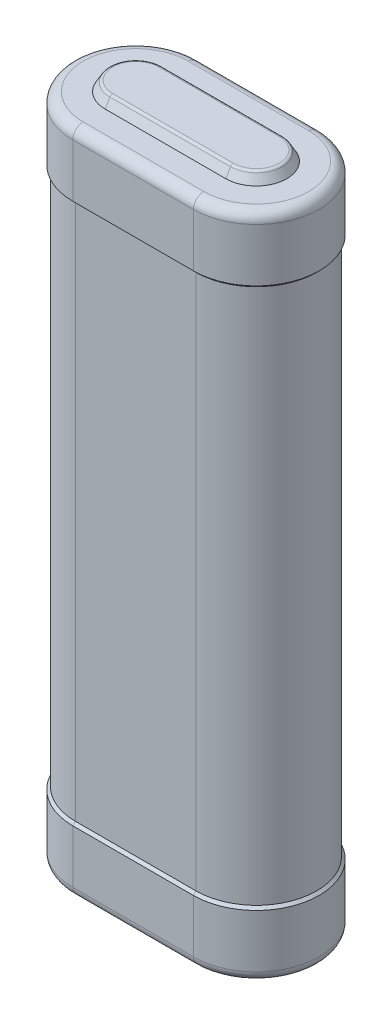
ISO-10303-21;
HEADER;
FILE_DESCRIPTION(('STEP AP214'),'2;1');
FILE_NAME('part.step','',(''),(''),'','','');
FILE_SCHEMA(('AUTOMOTIVE_DESIGN { 1 0 10303 214 1 1 1 1 }'));
ENDSEC;
DATA;
#1=APPLICATION_CONTEXT('core data for automotive mechanical design processes');
#2=APPLICATION_PROTOCOL_DEFINITION('international standard','automotive_design',2000,#1);
#3=PRODUCT_CONTEXT('',#1,'mechanical');
#4=PRODUCT('Part','Part','',(#3));
#5=PRODUCT_RELATED_PRODUCT_CATEGORY('part','',(#4));
#6=PRODUCT_DEFINITION_FORMATION('','',#4);
#7=PRODUCT_DEFINITION_CONTEXT('part definition',#1,'design');
#8=PRODUCT_DEFINITION('design','',#6,#7);
#9=PRODUCT_DEFINITION_SHAPE('','',#8);
#10=(LENGTH_UNIT() NAMED_UNIT(*) SI_UNIT(.MILLI.,.METRE.));
#11=(NAMED_UNIT(*) PLANE_ANGLE_UNIT() SI_UNIT($,.RADIAN.));
#12=(NAMED_UNIT(*) SI_UNIT($,.STERADIAN.) SOLID_ANGLE_UNIT());
#13=UNCERTAINTY_MEASURE_WITH_UNIT(LENGTH_MEASURE(1.E-05),#10,'distance_accuracy_value','');
#14=(GEOMETRIC_REPRESENTATION_CONTEXT(3) GLOBAL_UNCERTAINTY_ASSIGNED_CONTEXT((#13)) GLOBAL_UNIT_ASSIGNED_CONTEXT((#10,
#11,#12)) REPRESENTATION_CONTEXT('',''));
#15=CARTESIAN_POINT('',(0.,0.,0.));
#16=DIRECTION('',(0.,0.,1.));
#17=DIRECTION('',(1.,0.,0.));
#18=AXIS2_PLACEMENT_3D('',#15,#16,#17);
#19=CARTESIAN_POINT('',(-11.811,65.405,-10.287));
#20=DIRECTION('',(0.,1.,0.));
#21=DIRECTION('',(0.,0.,1.));
#22=AXIS2_PLACEMENT_3D('',#19,#20,#21);
#23=PLANE('',#22);
#24=DIRECTION('',(-1.,0.,0.));
#25=VECTOR('',#24,1.);
#26=CARTESIAN_POINT('',(-11.811,65.405,-10.287));
#27=LINE('',#26,#25);
#28=CARTESIAN_POINT('',(-11.811,65.405,-10.287));
#29=VERTEX_POINT('',#28);
#30=CARTESIAN_POINT('',(11.811,65.405,-10.287));
#31=VERTEX_POINT('',#30);
#32=EDGE_CURVE('E176',#29,#31,#27,.F.);
#33=ORIENTED_EDGE('',*,*,#32,.F.);
#34=CARTESIAN_POINT('',(-11.811,65.405,0.));
#35=DIRECTION('',(0.,-1.,0.));
#36=DIRECTION('',(0.,0.,1.));
#37=AXIS2_PLACEMENT_3D('',#34,#35,#36);
#38=CIRCLE('',#37,10.287);
#39=CARTESIAN_POINT('',(-11.811,65.405,10.287));
#40=VERTEX_POINT('',#39);
#41=EDGE_CURVE('E162',#29,#40,#38,.F.);
#42=ORIENTED_EDGE('',*,*,#41,.T.);
#43=DIRECTION('',(1.,0.,0.));
#44=VECTOR('',#43,1.);
#45=CARTESIAN_POINT('',(11.811,65.405,10.287));
#46=LINE('',#45,#44);
#47=CARTESIAN_POINT('',(11.811,65.405,10.287));
#48=VERTEX_POINT('',#47);
#49=EDGE_CURVE('E170',#48,#40,#46,.F.);
#50=ORIENTED_EDGE('',*,*,#49,.F.);
#51=CARTESIAN_POINT('',(11.811,65.405,0.));
#52=DIRECTION('',(0.,-1.,0.));
#53=DIRECTION('',(0.,0.,-1.));
#54=AXIS2_PLACEMENT_3D('',#51,#52,#53);
#55=CIRCLE('',#54,10.287);
#56=EDGE_CURVE('E269',#31,#48,#55,.T.);
#57=ORIENTED_EDGE('',*,*,#56,.F.);
#58=EDGE_LOOP('',(#33,#42,#50,#57));
#59=FACE_BOUND('',#58,.T.);
#60=ADVANCED_FACE('F47',(#59),#23,.T.);
#61=CARTESIAN_POINT('',(-11.811,-65.405,0.));
#62=DIRECTION('',(0.,1.,0.));
#63=DIRECTION('',(0.,0.,1.));
#64=AXIS2_PLACEMENT_3D('',#61,#62,#63);
#65=PLANE('',#64);
#66=DIRECTION('',(1.,0.,0.));
#67=VECTOR('',#66,1.);
#68=CARTESIAN_POINT('',(-11.811,-65.405,10.287));
#69=LINE('',#68,#67);
#70=CARTESIAN_POINT('',(-11.811,-65.405,10.287));
#71=VERTEX_POINT('',#70);
#72=CARTESIAN_POINT('',(11.811,-65.405,10.287));
#73=VERTEX_POINT('',#72);
#74=EDGE_CURVE('E395',#71,#73,#69,.T.);
#75=ORIENTED_EDGE('',*,*,#74,.F.);
#76=CARTESIAN_POINT('',(-11.811,-65.405,0.));
#77=DIRECTION('',(0.,1.,0.));
#78=DIRECTION('',(0.,0.,-1.));
#79=AXIS2_PLACEMENT_3D('',#76,#77,#78);
#80=CIRCLE('',#79,10.287);
#81=CARTESIAN_POINT('',(-11.811,-65.405,-10.287));
#82=VERTEX_POINT('',#81);
#83=EDGE_CURVE('E187',#82,#71,#80,.T.);
#84=ORIENTED_EDGE('',*,*,#83,.F.);
#85=DIRECTION('',(-1.,0.,0.));
#86=VECTOR('',#85,1.);
#87=CARTESIAN_POINT('',(-11.811,-65.405,-10.287));
#88=LINE('',#87,#86);
#89=CARTESIAN_POINT('',(11.811,-65.405,-10.287));
#90=VERTEX_POINT('',#89);
#91=EDGE_CURVE('E260',#90,#82,#88,.T.);
#92=ORIENTED_EDGE('',*,*,#91,.F.);
#93=CARTESIAN_POINT('',(11.811,-65.405,0.));
#94=DIRECTION('',(0.,1.,0.));
#95=DIRECTION('',(0.,0.,1.));
#96=AXIS2_PLACEMENT_3D('',#93,#94,#95);
#97=CIRCLE('',#96,10.287);
#98=EDGE_CURVE('E333',#73,#90,#97,.T.);
#99=ORIENTED_EDGE('',*,*,#98,.F.);
#100=EDGE_LOOP('',(#75,#84,#92,#99));
#101=FACE_BOUND('',#100,.T.);
#102=ADVANCED_FACE('F345',(#101),#65,.F.);
#103=CARTESIAN_POINT('',(11.811,-63.373,0.));
#104=DIRECTION('',(0.,1.,0.));
#105=DIRECTION('',(0.,0.,1.));
#106=AXIS2_PLACEMENT_3D('',#103,#104,#105);
#107=TOROIDAL_SURFACE('',#106,10.287,2.032);
#108=CARTESIAN_POINT('',(11.811,-63.373,10.287));
#109=DIRECTION('',(1.,0.,0.));
#110=DIRECTION('',(0.,0.,1.));
#111=AXIS2_PLACEMENT_3D('',#108,#109,#110);
#112=CIRCLE('',#111,2.032);
#113=CARTESIAN_POINT('',(11.811,-63.373,12.319));
#114=VERTEX_POINT('',#113);
#115=EDGE_CURVE('E358',#114,#73,#112,.T.);
#116=ORIENTED_EDGE('',*,*,#115,.T.);
#117=ORIENTED_EDGE('',*,*,#98,.T.);
#118=CARTESIAN_POINT('',(11.811,-63.373,-10.287));
#119=DIRECTION('',(-1.,0.,0.));
#120=DIRECTION('',(0.,0.,-1.));
#121=AXIS2_PLACEMENT_3D('',#118,#119,#120);
#122=CIRCLE('',#121,2.032);
#123=CARTESIAN_POINT('',(11.811,-63.373,-12.319));
#124=VERTEX_POINT('',#123);
#125=EDGE_CURVE('E366',#90,#124,#122,.F.);
#126=ORIENTED_EDGE('',*,*,#125,.T.);
#127=CARTESIAN_POINT('',(11.811,-63.373,0.));
#128=DIRECTION('',(0.,-1.,0.));
#129=DIRECTION('',(0.,0.,-1.));
#130=AXIS2_PLACEMENT_3D('',#127,#128,#129);
#131=CIRCLE('',#130,12.319);
#132=EDGE_CURVE('E315',#114,#124,#131,.F.);
#133=ORIENTED_EDGE('',*,*,#132,.F.);
#134=EDGE_LOOP('',(#116,#117,#126,#133));
#135=FACE_BOUND('',#134,.T.);
#136=ADVANCED_FACE('F339',(#135),#107,.T.);
#137=CARTESIAN_POINT('',(-11.811,-63.373,10.287));
#138=DIRECTION('',(1.,0.,0.));
#139=DIRECTION('',(0.,0.,-1.));
#140=AXIS2_PLACEMENT_3D('',#137,#138,#139);
#141=CYLINDRICAL_SURFACE('',#140,2.032);
#142=CARTESIAN_POINT('',(-11.811,-63.373,10.287));
#143=DIRECTION('',(1.,0.,0.));
#144=DIRECTION('',(0.,0.,-1.));
#145=AXIS2_PLACEMENT_3D('',#142,#143,#144);
#146=CIRCLE('',#145,2.032);
#147=CARTESIAN_POINT('',(-11.811,-63.373,12.319));
#148=VERTEX_POINT('',#147);
#149=EDGE_CURVE('E184',#148,#71,#146,.T.);
#150=ORIENTED_EDGE('',*,*,#149,.T.);
#151=ORIENTED_EDGE('',*,*,#74,.T.);
#152=ORIENTED_EDGE('',*,*,#115,.F.);
#153=DIRECTION('',(1.,0.,0.));
#154=VECTOR('',#153,1.);
#155=CARTESIAN_POINT('',(11.811,-63.373,12.319));
#156=LINE('',#155,#154);
#157=EDGE_CURVE('E371',#148,#114,#156,.T.);
#158=ORIENTED_EDGE('',*,*,#157,.F.);
#159=EDGE_LOOP('',(#150,#151,#152,#158));
#160=FACE_BOUND('',#159,.T.);
#161=ADVANCED_FACE('F344',(#160),#141,.T.);
#162=CARTESIAN_POINT('',(-11.811,-63.373,0.));
#163=DIRECTION('',(0.,1.,0.));
#164=DIRECTION('',(0.,0.,1.));
#165=AXIS2_PLACEMENT_3D('',#162,#163,#164);
#166=TOROIDAL_SURFACE('',#165,10.287,2.032);
#167=ORIENTED_EDGE('',*,*,#149,.F.);
#168=CARTESIAN_POINT('',(-11.811,-63.373,0.));
#169=DIRECTION('',(0.,-1.,0.));
#170=DIRECTION('',(0.,0.,-1.));
#171=AXIS2_PLACEMENT_3D('',#168,#169,#170);
#172=CIRCLE('',#171,12.319);
#173=CARTESIAN_POINT('',(-11.811,-63.373,-12.319));
#174=VERTEX_POINT('',#173);
#175=EDGE_CURVE('E261',#174,#148,#172,.F.);
#176=ORIENTED_EDGE('',*,*,#175,.F.);
#177=CARTESIAN_POINT('',(-11.811,-63.373,-10.287));
#178=DIRECTION('',(-1.,0.,0.));
#179=DIRECTION('',(0.,0.,1.));
#180=AXIS2_PLACEMENT_3D('',#177,#178,#179);
#181=CIRCLE('',#180,2.032);
#182=EDGE_CURVE('E257',#82,#174,#181,.F.);
#183=ORIENTED_EDGE('',*,*,#182,.F.);
#184=ORIENTED_EDGE('',*,*,#83,.T.);
#185=EDGE_LOOP('',(#167,#176,#183,#184));
#186=FACE_BOUND('',#185,.T.);
#187=ADVANCED_FACE('F221',(#186),#166,.T.);
#188=CARTESIAN_POINT('',(-11.811,-63.373,-10.287));
#189=DIRECTION('',(-1.,0.,0.));
#190=DIRECTION('',(0.,0.,1.));
#191=AXIS2_PLACEMENT_3D('',#188,#189,#190);
#192=CYLINDRICAL_SURFACE('',#191,2.032);
#193=ORIENTED_EDGE('',*,*,#125,.F.);
#194=ORIENTED_EDGE('',*,*,#91,.T.);
#195=ORIENTED_EDGE('',*,*,#182,.T.);
#196=DIRECTION('',(-1.,0.,0.));
#197=VECTOR('',#196,1.);
#198=CARTESIAN_POINT('',(-11.811,-63.373,-12.319));
#199=LINE('',#198,#197);
#200=EDGE_CURVE('E203',#124,#174,#199,.T.);
#201=ORIENTED_EDGE('',*,*,#200,.F.);
#202=EDGE_LOOP('',(#193,#194,#195,#201));
#203=FACE_BOUND('',#202,.T.);
#204=ADVANCED_FACE('F467',(#203),#192,.T.);
#205=CARTESIAN_POINT('',(11.811,-52.451,0.));
#206=DIRECTION('',(0.,-1.,0.));
#207=DIRECTION('',(0.,0.,-1.));
#208=AXIS2_PLACEMENT_3D('',#205,#206,#207);
#209=CYLINDRICAL_SURFACE('',#208,12.319);
#210=DIRECTION('',(0.,-1.,0.));
#211=VECTOR('',#210,1.);
#212=CARTESIAN_POINT('',(11.811,-52.451,12.319));
#213=LINE('',#212,#211);
#214=CARTESIAN_POINT('',(11.811,-52.959,12.319));
#215=VERTEX_POINT('',#214);
#216=EDGE_CURVE('E378',#215,#114,#213,.T.);
#217=ORIENTED_EDGE('',*,*,#216,.T.);
#218=ORIENTED_EDGE('',*,*,#132,.T.);
#219=DIRECTION('',(0.,-1.,0.));
#220=VECTOR('',#219,1.);
#221=CARTESIAN_POINT('',(11.811,-52.451,-12.319));
#222=LINE('',#221,#220);
#223=CARTESIAN_POINT('',(11.811,-52.959,-12.319));
#224=VERTEX_POINT('',#223);
#225=EDGE_CURVE('E318',#124,#224,#222,.F.);
#226=ORIENTED_EDGE('',*,*,#225,.T.);
#227=CARTESIAN_POINT('',(11.811,-52.959,0.));
#228=DIRECTION('',(0.,-1.,0.));
#229=DIRECTION('',(0.,0.,-1.));
#230=AXIS2_PLACEMENT_3D('',#227,#228,#229);
#231=CIRCLE('',#230,12.319);
#232=EDGE_CURVE('E421',#215,#224,#231,.F.);
#233=ORIENTED_EDGE('',*,*,#232,.F.);
#234=EDGE_LOOP('',(#217,#218,#226,#233));
#235=FACE_BOUND('',#234,.T.);
#236=ADVANCED_FACE('F419',(#235),#209,.T.);
#237=CARTESIAN_POINT('',(11.811,-52.451,12.319));
#238=DIRECTION('',(0.,0.,1.));
#239=DIRECTION('',(1.,0.,0.));
#240=AXIS2_PLACEMENT_3D('',#237,#238,#239);
#241=PLANE('',#240);
#242=DIRECTION('',(0.,1.,0.));
#243=VECTOR('',#242,1.);
#244=CARTESIAN_POINT('',(-11.811,-52.451,12.319));
#245=LINE('',#244,#243);
#246=CARTESIAN_POINT('',(-11.811,-52.959,12.319));
#247=VERTEX_POINT('',#246);
#248=EDGE_CURVE('E236',#247,#148,#245,.F.);
#249=ORIENTED_EDGE('',*,*,#248,.T.);
#250=ORIENTED_EDGE('',*,*,#157,.T.);
#251=ORIENTED_EDGE('',*,*,#216,.F.);
#252=DIRECTION('',(1.,0.,0.));
#253=VECTOR('',#252,1.);
#254=CARTESIAN_POINT('',(11.811,-52.959,12.319));
#255=LINE('',#254,#253);
#256=EDGE_CURVE('E324',#247,#215,#255,.T.);
#257=ORIENTED_EDGE('',*,*,#256,.F.);
#258=EDGE_LOOP('',(#249,#250,#251,#257));
#259=FACE_BOUND('',#258,.T.);
#260=ADVANCED_FACE('F349',(#259),#241,.T.);
#261=CARTESIAN_POINT('',(-11.811,-52.451,0.));
#262=DIRECTION('',(0.,-1.,0.));
#263=DIRECTION('',(0.,0.,-1.));
#264=AXIS2_PLACEMENT_3D('',#261,#262,#263);
#265=CYLINDRICAL_SURFACE('',#264,12.319);
#266=DIRECTION('',(0.,1.,0.));
#267=VECTOR('',#266,1.);
#268=CARTESIAN_POINT('',(-11.811,-52.451,-12.319));
#269=LINE('',#268,#267);
#270=CARTESIAN_POINT('',(-11.811,-52.959,-12.319));
#271=VERTEX_POINT('',#270);
#272=EDGE_CURVE('E250',#174,#271,#269,.T.);
#273=ORIENTED_EDGE('',*,*,#272,.F.);
#274=ORIENTED_EDGE('',*,*,#175,.T.);
#275=ORIENTED_EDGE('',*,*,#248,.F.);
#276=CARTESIAN_POINT('',(-11.811,-52.959,0.));
#277=DIRECTION('',(0.,-1.,0.));
#278=DIRECTION('',(0.,0.,-1.));
#279=AXIS2_PLACEMENT_3D('',#276,#277,#278);
#280=CIRCLE('',#279,12.319);
#281=EDGE_CURVE('E252',#271,#247,#280,.F.);
#282=ORIENTED_EDGE('',*,*,#281,.F.);
#283=EDGE_LOOP('',(#273,#274,#275,#282));
#284=FACE_BOUND('',#283,.T.);
#285=ADVANCED_FACE('F464',(#284),#265,.T.);
#286=CARTESIAN_POINT('',(-11.811,-52.451,-12.319));
#287=DIRECTION('',(0.,0.,-1.));
#288=DIRECTION('',(-1.,0.,0.));
#289=AXIS2_PLACEMENT_3D('',#286,#287,#288);
#290=PLANE('',#289);
#291=ORIENTED_EDGE('',*,*,#225,.F.);
#292=ORIENTED_EDGE('',*,*,#200,.T.);
#293=ORIENTED_EDGE('',*,*,#272,.T.);
#294=DIRECTION('',(1.,0.,0.));
#295=VECTOR('',#294,1.);
#296=CARTESIAN_POINT('',(-11.811,-52.959,-12.319));
#297=LINE('',#296,#295);
#298=EDGE_CURVE('E302',#224,#271,#297,.F.);
#299=ORIENTED_EDGE('',*,*,#298,.F.);
#300=EDGE_LOOP('',(#291,#292,#293,#299));
#301=FACE_BOUND('',#300,.T.);
#302=ADVANCED_FACE('F463',(#301),#290,.T.);
#303=CARTESIAN_POINT('',(11.811,-52.959,0.));
#304=DIRECTION('',(0.,-1.,0.));
#305=DIRECTION('',(0.,0.,-1.));
#306=AXIS2_PLACEMENT_3D('',#303,#304,#305);
#307=CONICAL_SURFACE('',#306,12.319,0.785398163397447);
#308=DIRECTION('',(0.,-0.707106781186548,0.707106781186548));
#309=VECTOR('',#308,1.);
#310=CARTESIAN_POINT('',(11.811,-52.959,12.319));
#311=LINE('',#310,#309);
#312=CARTESIAN_POINT('',(11.811,-52.451,11.811));
#313=VERTEX_POINT('',#312);
#314=EDGE_CURVE('E322',#215,#313,#311,.F.);
#315=ORIENTED_EDGE('',*,*,#314,.F.);
#316=ORIENTED_EDGE('',*,*,#232,.T.);
#317=DIRECTION('',(0.,0.707106781186548,0.707106781186547));
#318=VECTOR('',#317,1.);
#319=CARTESIAN_POINT('',(11.811,-52.959,-12.319));
#320=LINE('',#319,#318);
#321=CARTESIAN_POINT('',(11.811,-52.451,-11.811));
#322=VERTEX_POINT('',#321);
#323=EDGE_CURVE('E425',#224,#322,#320,.T.);
#324=ORIENTED_EDGE('',*,*,#323,.T.);
#325=CARTESIAN_POINT('',(11.811,-52.451,0.));
#326=DIRECTION('',(0.,-1.,0.));
#327=DIRECTION('',(0.,0.,-1.));
#328=AXIS2_PLACEMENT_3D('',#325,#326,#327);
#329=CIRCLE('',#328,11.811);
#330=EDGE_CURVE('E58',#313,#322,#329,.F.);
#331=ORIENTED_EDGE('',*,*,#330,.F.);
#332=EDGE_LOOP('',(#315,#316,#324,#331));
#333=FACE_BOUND('',#332,.T.);
#334=ADVANCED_FACE('F460',(#333),#307,.T.);
#335=CARTESIAN_POINT('',(11.811,-52.959,12.319));
#336=DIRECTION('',(0.,0.707106781186548,0.707106781186548));
#337=DIRECTION('',(0.,-0.707106781186548,0.707106781186548));
#338=AXIS2_PLACEMENT_3D('',#335,#336,#337);
#339=PLANE('',#338);
#340=ORIENTED_EDGE('',*,*,#314,.T.);
#341=DIRECTION('',(-1.,0.,0.));
#342=VECTOR('',#341,1.);
#343=CARTESIAN_POINT('',(-11.811,-52.451,11.811));
#344=LINE('',#343,#342);
#345=CARTESIAN_POINT('',(-11.811,-52.451,11.811));
#346=VERTEX_POINT('',#345);
#347=EDGE_CURVE('E406',#313,#346,#344,.T.);
#348=ORIENTED_EDGE('',*,*,#347,.T.);
#349=DIRECTION('',(0.,-0.707106781186548,0.707106781186548));
#350=VECTOR('',#349,1.);
#351=CARTESIAN_POINT('',(-11.811,-52.959,12.319));
#352=LINE('',#351,#350);
#353=EDGE_CURVE('E207',#346,#247,#352,.T.);
#354=ORIENTED_EDGE('',*,*,#353,.T.);
#355=ORIENTED_EDGE('',*,*,#256,.T.);
#356=EDGE_LOOP('',(#340,#348,#354,#355));
#357=FACE_BOUND('',#356,.T.);
#358=ADVANCED_FACE('F403',(#357),#339,.T.);
#359=CARTESIAN_POINT('',(-11.811,-52.959,0.));
#360=DIRECTION('',(0.,-1.,0.));
#361=DIRECTION('',(0.,0.,-1.));
#362=AXIS2_PLACEMENT_3D('',#359,#360,#361);
#363=CONICAL_SURFACE('',#362,12.319,0.785398163397448);
#364=DIRECTION('',(0.,0.707106781186548,0.707106781186547));
#365=VECTOR('',#364,1.);
#366=CARTESIAN_POINT('',(-11.811,-52.959,-12.319));
#367=LINE('',#366,#365);
#368=CARTESIAN_POINT('',(-11.811,-52.451,-11.811));
#369=VERTEX_POINT('',#368);
#370=EDGE_CURVE('E326',#369,#271,#367,.F.);
#371=ORIENTED_EDGE('',*,*,#370,.T.);
#372=ORIENTED_EDGE('',*,*,#281,.T.);
#373=ORIENTED_EDGE('',*,*,#353,.F.);
#374=CARTESIAN_POINT('',(-11.811,-52.451,0.));
#375=DIRECTION('',(0.,-1.,0.));
#376=DIRECTION('',(0.,0.,-1.));
#377=AXIS2_PLACEMENT_3D('',#374,#375,#376);
#378=CIRCLE('',#377,11.811);
#379=EDGE_CURVE('E306',#369,#346,#378,.F.);
#380=ORIENTED_EDGE('',*,*,#379,.F.);
#381=EDGE_LOOP('',(#371,#372,#373,#380));
#382=FACE_BOUND('',#381,.T.);
#383=ADVANCED_FACE('F409',(#382),#363,.T.);
#384=CARTESIAN_POINT('',(-11.811,-52.959,-12.319));
#385=DIRECTION('',(0.,0.707106781186548,-0.707106781186548));
#386=DIRECTION('',(0.,0.707106781186548,0.707106781186548));
#387=AXIS2_PLACEMENT_3D('',#384,#385,#386);
#388=PLANE('',#387);
#389=ORIENTED_EDGE('',*,*,#323,.F.);
#390=ORIENTED_EDGE('',*,*,#298,.T.);
#391=ORIENTED_EDGE('',*,*,#370,.F.);
#392=DIRECTION('',(1.,0.,0.));
#393=VECTOR('',#392,1.);
#394=CARTESIAN_POINT('',(-11.811,-52.451,-11.811));
#395=LINE('',#394,#393);
#396=EDGE_CURVE('E67',#369,#322,#395,.T.);
#397=ORIENTED_EDGE('',*,*,#396,.T.);
#398=EDGE_LOOP('',(#389,#390,#391,#397));
#399=FACE_BOUND('',#398,.T.);
#400=ADVANCED_FACE('F461',(#399),#388,.T.);
#401=CARTESIAN_POINT('',(11.811,65.405,0.));
#402=DIRECTION('',(0.,-1.,0.));
#403=DIRECTION('',(0.,0.,-1.));
#404=AXIS2_PLACEMENT_3D('',#401,#402,#403);
#405=CYLINDRICAL_SURFACE('',#404,11.811);
#406=ORIENTED_EDGE('',*,*,#330,.T.);
#407=DIRECTION('',(0.,-1.,0.));
#408=VECTOR('',#407,1.);
#409=CARTESIAN_POINT('',(11.811,65.405,-11.811));
#410=LINE('',#409,#408);
#411=CARTESIAN_POINT('',(11.811,52.451,-11.811));
#412=VERTEX_POINT('',#411);
#413=EDGE_CURVE('E12',#322,#412,#410,.F.);
#414=ORIENTED_EDGE('',*,*,#413,.T.);
#415=CARTESIAN_POINT('',(11.811,52.451,0.));
#416=DIRECTION('',(0.,-1.,0.));
#417=DIRECTION('',(0.,0.,-1.));
#418=AXIS2_PLACEMENT_3D('',#415,#416,#417);
#419=CIRCLE('',#418,11.811);
#420=CARTESIAN_POINT('',(11.811,52.451,11.811));
#421=VERTEX_POINT('',#420);
#422=EDGE_CURVE('E443',#412,#421,#419,.T.);
#423=ORIENTED_EDGE('',*,*,#422,.T.);
#424=DIRECTION('',(0.,-1.,0.));
#425=VECTOR('',#424,1.);
#426=CARTESIAN_POINT('',(11.811,65.405,11.811));
#427=LINE('',#426,#425);
#428=EDGE_CURVE('E447',#421,#313,#427,.T.);
#429=ORIENTED_EDGE('',*,*,#428,.T.);
#430=EDGE_LOOP('',(#406,#414,#423,#429));
#431=FACE_BOUND('',#430,.T.);
#432=ADVANCED_FACE('F456',(#431),#405,.T.);
#433=CARTESIAN_POINT('',(-11.811,65.405,11.811));
#434=DIRECTION('',(0.,0.,-1.));
#435=DIRECTION('',(-1.,0.,0.));
#436=AXIS2_PLACEMENT_3D('',#433,#434,#435);
#437=PLANE('',#436);
#438=DIRECTION('',(0.,1.,0.));
#439=VECTOR('',#438,1.);
#440=CARTESIAN_POINT('',(-11.811,65.405,11.811));
#441=LINE('',#440,#439);
#442=CARTESIAN_POINT('',(-11.811,52.451,11.811));
#443=VERTEX_POINT('',#442);
#444=EDGE_CURVE('E433',#346,#443,#441,.T.);
#445=ORIENTED_EDGE('',*,*,#444,.F.);
#446=ORIENTED_EDGE('',*,*,#347,.F.);
#447=ORIENTED_EDGE('',*,*,#428,.F.);
#448=DIRECTION('',(-1.,0.,0.));
#449=VECTOR('',#448,1.);
#450=CARTESIAN_POINT('',(-11.811,52.451,11.811));
#451=LINE('',#450,#449);
#452=EDGE_CURVE('E428',#443,#421,#451,.F.);
#453=ORIENTED_EDGE('',*,*,#452,.F.);
#454=EDGE_LOOP('',(#445,#446,#447,#453));
#455=FACE_BOUND('',#454,.T.);
#456=ADVANCED_FACE('F532',(#455),#437,.F.);
#457=CARTESIAN_POINT('',(-11.811,65.405,0.));
#458=DIRECTION('',(0.,-1.,0.));
#459=DIRECTION('',(0.,0.,-1.));
#460=AXIS2_PLACEMENT_3D('',#457,#458,#459);
#461=CYLINDRICAL_SURFACE('',#460,11.811);
#462=ORIENTED_EDGE('',*,*,#379,.T.);
#463=ORIENTED_EDGE('',*,*,#444,.T.);
#464=CARTESIAN_POINT('',(-11.811,52.451,0.));
#465=DIRECTION('',(0.,-1.,0.));
#466=DIRECTION('',(0.,0.,-1.));
#467=AXIS2_PLACEMENT_3D('',#464,#465,#466);
#468=CIRCLE('',#467,11.811);
#469=CARTESIAN_POINT('',(-11.811,52.451,-11.811));
#470=VERTEX_POINT('',#469);
#471=EDGE_CURVE('E312',#443,#470,#468,.T.);
#472=ORIENTED_EDGE('',*,*,#471,.T.);
#473=DIRECTION('',(0.,1.,0.));
#474=VECTOR('',#473,1.);
#475=CARTESIAN_POINT('',(-11.811,65.405,-11.811));
#476=LINE('',#475,#474);
#477=EDGE_CURVE('E424',#470,#369,#476,.F.);
#478=ORIENTED_EDGE('',*,*,#477,.T.);
#479=EDGE_LOOP('',(#462,#463,#472,#478));
#480=FACE_BOUND('',#479,.T.);
#481=ADVANCED_FACE('F534',(#480),#461,.T.);
#482=CARTESIAN_POINT('',(-11.811,65.405,-11.811));
#483=DIRECTION('',(0.,0.,1.));
#484=DIRECTION('',(1.,0.,0.));
#485=AXIS2_PLACEMENT_3D('',#482,#483,#484);
#486=PLANE('',#485);
#487=ORIENTED_EDGE('',*,*,#413,.F.);
#488=ORIENTED_EDGE('',*,*,#396,.F.);
#489=ORIENTED_EDGE('',*,*,#477,.F.);
#490=DIRECTION('',(1.,0.,0.));
#491=VECTOR('',#490,1.);
#492=CARTESIAN_POINT('',(-11.811,52.451,-11.811));
#493=LINE('',#492,#491);
#494=EDGE_CURVE('E448',#412,#470,#493,.F.);
#495=ORIENTED_EDGE('',*,*,#494,.F.);
#496=EDGE_LOOP('',(#487,#488,#489,#495));
#497=FACE_BOUND('',#496,.T.);
#498=ADVANCED_FACE('F453',(#497),#486,.F.);
#499=CARTESIAN_POINT('',(11.811,52.959,0.));
#500=DIRECTION('',(0.,1.,0.));
#501=DIRECTION('',(-1.,0.,0.));
#502=AXIS2_PLACEMENT_3D('',#499,#500,#501);
#503=CONICAL_SURFACE('',#502,12.319,0.785398163397448);
#504=DIRECTION('',(0.,-0.707106781186547,-0.707106781186548));
#505=VECTOR('',#504,1.);
#506=CARTESIAN_POINT('',(11.811,52.451,11.811));
#507=LINE('',#506,#505);
#508=CARTESIAN_POINT('',(11.811,52.959,12.319));
#509=VERTEX_POINT('',#508);
#510=EDGE_CURVE('E437',#509,#421,#507,.T.);
#511=ORIENTED_EDGE('',*,*,#510,.T.);
#512=ORIENTED_EDGE('',*,*,#422,.F.);
#513=DIRECTION('',(0.,-0.707106781186547,0.707106781186548));
#514=VECTOR('',#513,1.);
#515=CARTESIAN_POINT('',(11.811,52.451,-11.811));
#516=LINE('',#515,#514);
#517=CARTESIAN_POINT('',(11.811,52.959,-12.319));
#518=VERTEX_POINT('',#517);
#519=EDGE_CURVE('E299',#412,#518,#516,.F.);
#520=ORIENTED_EDGE('',*,*,#519,.T.);
#521=CARTESIAN_POINT('',(11.811,52.959,0.));
#522=DIRECTION('',(0.,1.,0.));
#523=DIRECTION('',(0.,0.,1.));
#524=AXIS2_PLACEMENT_3D('',#521,#522,#523);
#525=CIRCLE('',#524,12.319);
#526=EDGE_CURVE('E288',#518,#509,#525,.F.);
#527=ORIENTED_EDGE('',*,*,#526,.T.);
#528=EDGE_LOOP('',(#511,#512,#520,#527));
#529=FACE_BOUND('',#528,.T.);
#530=ADVANCED_FACE('F440',(#529),#503,.T.);
#531=CARTESIAN_POINT('',(11.811,52.451,11.811));
#532=DIRECTION('',(0.,0.707106781186548,-0.707106781186548));
#533=DIRECTION('',(0.,0.707106781186548,0.707106781186548));
#534=AXIS2_PLACEMENT_3D('',#531,#532,#533);
#535=PLANE('',#534);
#536=DIRECTION('',(1.,0.,0.));
#537=VECTOR('',#536,1.);
#538=CARTESIAN_POINT('',(11.811,52.959,12.319));
#539=LINE('',#538,#537);
#540=CARTESIAN_POINT('',(-11.811,52.959,12.319));
#541=VERTEX_POINT('',#540);
#542=EDGE_CURVE('E316',#541,#509,#539,.T.);
#543=ORIENTED_EDGE('',*,*,#542,.F.);
#544=DIRECTION('',(0.,0.707106781186548,0.707106781186548));
#545=VECTOR('',#544,1.);
#546=CARTESIAN_POINT('',(-11.811,52.451,11.811));
#547=LINE('',#546,#545);
#548=EDGE_CURVE('E319',#443,#541,#547,.T.);
#549=ORIENTED_EDGE('',*,*,#548,.F.);
#550=ORIENTED_EDGE('',*,*,#452,.T.);
#551=ORIENTED_EDGE('',*,*,#510,.F.);
#552=EDGE_LOOP('',(#543,#549,#550,#551));
#553=FACE_BOUND('',#552,.T.);
#554=ADVANCED_FACE('F528',(#553),#535,.F.);
#555=CARTESIAN_POINT('',(-11.811,52.959,0.));
#556=DIRECTION('',(0.,1.,0.));
#557=DIRECTION('',(-1.,0.,0.));
#558=AXIS2_PLACEMENT_3D('',#555,#556,#557);
#559=CONICAL_SURFACE('',#558,12.319,0.785398163397448);
#560=DIRECTION('',(0.,-0.707106781186548,0.707106781186547));
#561=VECTOR('',#560,1.);
#562=CARTESIAN_POINT('',(-11.811,52.451,-11.811));
#563=LINE('',#562,#561);
#564=CARTESIAN_POINT('',(-11.811,52.959,-12.319));
#565=VERTEX_POINT('',#564);
#566=EDGE_CURVE('E301',#565,#470,#563,.T.);
#567=ORIENTED_EDGE('',*,*,#566,.T.);
#568=ORIENTED_EDGE('',*,*,#471,.F.);
#569=ORIENTED_EDGE('',*,*,#548,.T.);
#570=CARTESIAN_POINT('',(-11.811,52.959,0.));
#571=DIRECTION('',(0.,1.,0.));
#572=DIRECTION('',(0.,0.,1.));
#573=AXIS2_PLACEMENT_3D('',#570,#571,#572);
#574=CIRCLE('',#573,12.319);
#575=EDGE_CURVE('E330',#541,#565,#574,.F.);
#576=ORIENTED_EDGE('',*,*,#575,.T.);
#577=EDGE_LOOP('',(#567,#568,#569,#576));
#578=FACE_BOUND('',#577,.T.);
#579=ADVANCED_FACE('F347',(#578),#559,.T.);
#580=CARTESIAN_POINT('',(11.811,52.451,-11.811));
#581=DIRECTION('',(0.,0.707106781186548,0.707106781186548));
#582=DIRECTION('',(0.,-0.707106781186548,0.707106781186548));
#583=AXIS2_PLACEMENT_3D('',#580,#581,#582);
#584=PLANE('',#583);
#585=ORIENTED_EDGE('',*,*,#494,.T.);
#586=ORIENTED_EDGE('',*,*,#566,.F.);
#587=DIRECTION('',(1.,0.,0.));
#588=VECTOR('',#587,1.);
#589=CARTESIAN_POINT('',(11.811,52.959,-12.319));
#590=LINE('',#589,#588);
#591=EDGE_CURVE('E295',#518,#565,#590,.F.);
#592=ORIENTED_EDGE('',*,*,#591,.F.);
#593=ORIENTED_EDGE('',*,*,#519,.F.);
#594=EDGE_LOOP('',(#585,#586,#592,#593));
#595=FACE_BOUND('',#594,.T.);
#596=ADVANCED_FACE('F298',(#595),#584,.F.);
#597=CARTESIAN_POINT('',(11.811,52.451,0.));
#598=DIRECTION('',(0.,1.,0.));
#599=DIRECTION('',(0.,0.,1.));
#600=AXIS2_PLACEMENT_3D('',#597,#598,#599);
#601=CYLINDRICAL_SURFACE('',#600,12.319);
#602=DIRECTION('',(0.,1.,0.));
#603=VECTOR('',#602,1.);
#604=CARTESIAN_POINT('',(11.811,52.451,-12.319));
#605=LINE('',#604,#603);
#606=CARTESIAN_POINT('',(11.811,63.373,-12.319));
#607=VERTEX_POINT('',#606);
#608=EDGE_CURVE('E208',#518,#607,#605,.T.);
#609=ORIENTED_EDGE('',*,*,#608,.T.);
#610=CARTESIAN_POINT('',(11.811,63.373,0.));
#611=DIRECTION('',(0.,1.,0.));
#612=DIRECTION('',(0.,0.,1.));
#613=AXIS2_PLACEMENT_3D('',#610,#611,#612);
#614=CIRCLE('',#613,12.319);
#615=CARTESIAN_POINT('',(11.811,63.373,12.319));
#616=VERTEX_POINT('',#615);
#617=EDGE_CURVE('E204',#607,#616,#614,.F.);
#618=ORIENTED_EDGE('',*,*,#617,.T.);
#619=DIRECTION('',(0.,1.,0.));
#620=VECTOR('',#619,1.);
#621=CARTESIAN_POINT('',(11.811,52.451,12.319));
#622=LINE('',#621,#620);
#623=EDGE_CURVE('E211',#616,#509,#622,.F.);
#624=ORIENTED_EDGE('',*,*,#623,.T.);
#625=ORIENTED_EDGE('',*,*,#526,.F.);
#626=EDGE_LOOP('',(#609,#618,#624,#625));
#627=FACE_BOUND('',#626,.T.);
#628=ADVANCED_FACE('F283',(#627),#601,.T.);
#629=CARTESIAN_POINT('',(11.811,52.451,12.319));
#630=DIRECTION('',(0.,0.,-1.));
#631=DIRECTION('',(-1.,0.,0.));
#632=AXIS2_PLACEMENT_3D('',#629,#630,#631);
#633=PLANE('',#632);
#634=ORIENTED_EDGE('',*,*,#542,.T.);
#635=ORIENTED_EDGE('',*,*,#623,.F.);
#636=DIRECTION('',(-1.,0.,0.));
#637=VECTOR('',#636,1.);
#638=CARTESIAN_POINT('',(11.811,63.373,12.319));
#639=LINE('',#638,#637);
#640=CARTESIAN_POINT('',(-11.811,63.373,12.319));
#641=VERTEX_POINT('',#640);
#642=EDGE_CURVE('E232',#641,#616,#639,.F.);
#643=ORIENTED_EDGE('',*,*,#642,.F.);
#644=DIRECTION('',(0.,1.,0.));
#645=VECTOR('',#644,1.);
#646=CARTESIAN_POINT('',(-11.811,52.451,12.319));
#647=LINE('',#646,#645);
#648=EDGE_CURVE('E234',#541,#641,#647,.T.);
#649=ORIENTED_EDGE('',*,*,#648,.F.);
#650=EDGE_LOOP('',(#634,#635,#643,#649));
#651=FACE_BOUND('',#650,.T.);
#652=ADVANCED_FACE('F514',(#651),#633,.F.);
#653=CARTESIAN_POINT('',(-11.811,52.451,0.));
#654=DIRECTION('',(0.,1.,0.));
#655=DIRECTION('',(0.,0.,1.));
#656=AXIS2_PLACEMENT_3D('',#653,#654,#655);
#657=CYLINDRICAL_SURFACE('',#656,12.319);
#658=ORIENTED_EDGE('',*,*,#648,.T.);
#659=CARTESIAN_POINT('',(-11.811,63.373,0.));
#660=DIRECTION('',(0.,1.,0.));
#661=DIRECTION('',(0.,0.,1.));
#662=AXIS2_PLACEMENT_3D('',#659,#660,#661);
#663=CIRCLE('',#662,12.319);
#664=CARTESIAN_POINT('',(-11.811,63.373,-12.319));
#665=VERTEX_POINT('',#664);
#666=EDGE_CURVE('E166',#641,#665,#663,.F.);
#667=ORIENTED_EDGE('',*,*,#666,.T.);
#668=DIRECTION('',(0.,1.,0.));
#669=VECTOR('',#668,1.);
#670=CARTESIAN_POINT('',(-11.811,52.451,-12.319));
#671=LINE('',#670,#669);
#672=EDGE_CURVE('E202',#665,#565,#671,.F.);
#673=ORIENTED_EDGE('',*,*,#672,.T.);
#674=ORIENTED_EDGE('',*,*,#575,.F.);
#675=EDGE_LOOP('',(#658,#667,#673,#674));
#676=FACE_BOUND('',#675,.T.);
#677=ADVANCED_FACE('F512',(#676),#657,.T.);
#678=CARTESIAN_POINT('',(-11.811,52.451,-12.319));
#679=DIRECTION('',(0.,0.,1.));
#680=DIRECTION('',(1.,0.,0.));
#681=AXIS2_PLACEMENT_3D('',#678,#679,#680);
#682=PLANE('',#681);
#683=ORIENTED_EDGE('',*,*,#591,.T.);
#684=ORIENTED_EDGE('',*,*,#672,.F.);
#685=DIRECTION('',(1.,0.,0.));
#686=VECTOR('',#685,1.);
#687=CARTESIAN_POINT('',(-11.811,63.373,-12.319));
#688=LINE('',#687,#686);
#689=EDGE_CURVE('E199',#607,#665,#688,.F.);
#690=ORIENTED_EDGE('',*,*,#689,.F.);
#691=ORIENTED_EDGE('',*,*,#608,.F.);
#692=EDGE_LOOP('',(#683,#684,#690,#691));
#693=FACE_BOUND('',#692,.T.);
#694=ADVANCED_FACE('F294',(#693),#682,.F.);
#695=CARTESIAN_POINT('',(11.811,63.373,0.));
#696=DIRECTION('',(0.,1.,0.));
#697=DIRECTION('',(0.,0.,1.));
#698=AXIS2_PLACEMENT_3D('',#695,#696,#697);
#699=TOROIDAL_SURFACE('',#698,10.287,2.032);
#700=CARTESIAN_POINT('',(11.811,63.373,10.287));
#701=DIRECTION('',(1.,0.,0.));
#702=DIRECTION('',(0.,0.,1.));
#703=AXIS2_PLACEMENT_3D('',#700,#701,#702);
#704=CIRCLE('',#703,2.032);
#705=EDGE_CURVE('E182',#48,#616,#704,.T.);
#706=ORIENTED_EDGE('',*,*,#705,.T.);
#707=ORIENTED_EDGE('',*,*,#617,.F.);
#708=CARTESIAN_POINT('',(11.811,63.373,-10.287));
#709=DIRECTION('',(-1.,0.,0.));
#710=DIRECTION('',(0.,0.,-1.));
#711=AXIS2_PLACEMENT_3D('',#708,#709,#710);
#712=CIRCLE('',#711,2.032);
#713=EDGE_CURVE('E264',#607,#31,#712,.F.);
#714=ORIENTED_EDGE('',*,*,#713,.T.);
#715=ORIENTED_EDGE('',*,*,#56,.T.);
#716=EDGE_LOOP('',(#706,#707,#714,#715));
#717=FACE_BOUND('',#716,.T.);
#718=ADVANCED_FACE('F280',(#717),#699,.T.);
#719=CARTESIAN_POINT('',(11.811,63.373,10.287));
#720=DIRECTION('',(1.,0.,0.));
#721=DIRECTION('',(0.,0.,-1.));
#722=AXIS2_PLACEMENT_3D('',#719,#720,#721);
#723=CYLINDRICAL_SURFACE('',#722,2.032);
#724=ORIENTED_EDGE('',*,*,#705,.F.);
#725=ORIENTED_EDGE('',*,*,#49,.T.);
#726=CARTESIAN_POINT('',(-11.811,63.373,10.287));
#727=DIRECTION('',(1.,0.,0.));
#728=DIRECTION('',(0.,0.,-1.));
#729=AXIS2_PLACEMENT_3D('',#726,#727,#728);
#730=CIRCLE('',#729,2.032);
#731=EDGE_CURVE('E159',#40,#641,#730,.T.);
#732=ORIENTED_EDGE('',*,*,#731,.T.);
#733=ORIENTED_EDGE('',*,*,#642,.T.);
#734=EDGE_LOOP('',(#724,#725,#732,#733));
#735=FACE_BOUND('',#734,.T.);
#736=ADVANCED_FACE('F180',(#735),#723,.T.);
#737=CARTESIAN_POINT('',(-11.811,63.373,0.));
#738=DIRECTION('',(0.,1.,0.));
#739=DIRECTION('',(0.,0.,1.));
#740=AXIS2_PLACEMENT_3D('',#737,#738,#739);
#741=TOROIDAL_SURFACE('',#740,10.287,2.032);
#742=CARTESIAN_POINT('',(-11.811,63.373,-10.287));
#743=DIRECTION('',(-1.,0.,0.));
#744=DIRECTION('',(0.,0.,1.));
#745=AXIS2_PLACEMENT_3D('',#742,#743,#744);
#746=CIRCLE('',#745,2.032);
#747=EDGE_CURVE('E196',#665,#29,#746,.F.);
#748=ORIENTED_EDGE('',*,*,#747,.F.);
#749=ORIENTED_EDGE('',*,*,#666,.F.);
#750=ORIENTED_EDGE('',*,*,#731,.F.);
#751=ORIENTED_EDGE('',*,*,#41,.F.);
#752=EDGE_LOOP('',(#748,#749,#750,#751));
#753=FACE_BOUND('',#752,.T.);
#754=ADVANCED_FACE('F161',(#753),#741,.T.);
#755=CARTESIAN_POINT('',(-11.811,63.373,-10.287));
#756=DIRECTION('',(-1.,0.,0.));
#757=DIRECTION('',(0.,0.,1.));
#758=AXIS2_PLACEMENT_3D('',#755,#756,#757);
#759=CYLINDRICAL_SURFACE('',#758,2.032);
#760=ORIENTED_EDGE('',*,*,#713,.F.);
#761=ORIENTED_EDGE('',*,*,#689,.T.);
#762=ORIENTED_EDGE('',*,*,#747,.T.);
#763=ORIENTED_EDGE('',*,*,#32,.T.);
#764=EDGE_LOOP('',(#760,#761,#762,#763));
#765=FACE_BOUND('',#764,.T.);
#766=ADVANCED_FACE('F219',(#765),#759,.T.);
#767=CLOSED_SHELL('',(#60,#102,#136,#161,#187,#204,#236,#260,#285,#302,#334,#358,#383,#400,#432,
#456,#481,#498,#530,#554,#579,#596,#628,#652,#677,#694,#718,#736,#754,#766));
#768=MANIFOLD_SOLID_BREP('B2',#767);
#769=CARTESIAN_POINT('',(-11.811,65.405,-10.287));
#770=DIRECTION('',(0.,1.,0.));
#771=DIRECTION('',(0.,0.,1.));
#772=AXIS2_PLACEMENT_3D('',#769,#770,#771);
#773=PLANE('',#772);
#774=DIRECTION('',(1.,0.,0.));
#775=VECTOR('',#774,1.);
#776=CARTESIAN_POINT('',(-11.811,65.405,-5.969));
#777=LINE('',#776,#775);
#778=CARTESIAN_POINT('',(-11.811,65.405000000084,-5.96899999996989));
#779=VERTEX_POINT('',#778);
#780=CARTESIAN_POINT('',(11.811,65.4050000000414,-5.96899999999492));
#781=VERTEX_POINT('',#780);
#782=EDGE_CURVE('E827',#779,#781,#777,.T.);
#783=ORIENTED_EDGE('',*,*,#782,.T.);
#784=CARTESIAN_POINT('',(11.811,65.4050000000552,0.));
#785=DIRECTION('',(0.,-1.,0.));
#786=DIRECTION('',(0.,0.,-1.));
#787=AXIS2_PLACEMENT_3D('',#784,#785,#786);
#788=CIRCLE('',#787,5.96899999999323);
#789=CARTESIAN_POINT('',(11.811,65.4050000000276,5.96899999998411));
#790=VERTEX_POINT('',#789);
#791=EDGE_CURVE('E928',#781,#790,#788,.T.);
#792=ORIENTED_EDGE('',*,*,#791,.T.);
#793=DIRECTION('',(1.,0.,0.));
#794=VECTOR('',#793,1.);
#795=CARTESIAN_POINT('',(-11.811,65.405,5.96900000000001));
#796=LINE('',#795,#794);
#797=CARTESIAN_POINT('',(-11.811,65.4050000000414,5.96899999999831));
#798=VERTEX_POINT('',#797);
#799=EDGE_CURVE('E771',#790,#798,#796,.F.);
#800=ORIENTED_EDGE('',*,*,#799,.T.);
#801=CARTESIAN_POINT('',(-11.811,65.4050000000552,0.));
#802=DIRECTION('',(0.,-1.,0.));
#803=DIRECTION('',(0.,0.,-1.));
#804=AXIS2_PLACEMENT_3D('',#801,#802,#803);
#805=CIRCLE('',#804,5.968999999978);
#806=EDGE_CURVE('E45',#798,#779,#805,.T.);
#807=ORIENTED_EDGE('',*,*,#806,.T.);
#808=EDGE_LOOP('',(#783,#792,#800,#807));
#809=FACE_BOUND('',#808,.T.);
#810=ADVANCED_FACE('F762',(#809),#773,.F.);
#811=CARTESIAN_POINT('',(0.,67.31,0.));
#812=DIRECTION('',(0.,1.,0.));
#813=DIRECTION('',(0.,0.,1.));
#814=AXIS2_PLACEMENT_3D('',#811,#812,#813);
#815=PLANE('',#814);
#816=CARTESIAN_POINT('',(11.811,67.31,0.));
#817=DIRECTION('',(0.,-1.,0.));
#818=DIRECTION('',(0.,0.,-1.));
#819=AXIS2_PLACEMENT_3D('',#816,#817,#818);
#820=CIRCLE('',#819,4.50253031625843);
#821=CARTESIAN_POINT('',(11.811,67.31,-4.50253031625843));
#822=VERTEX_POINT('',#821);
#823=CARTESIAN_POINT('',(11.811,67.31,4.50253031625843));
#824=VERTEX_POINT('',#823);
#825=EDGE_CURVE('E823',#822,#824,#820,.T.);
#826=ORIENTED_EDGE('',*,*,#825,.F.);
#827=DIRECTION('',(-1.,0.,0.));
#828=VECTOR('',#827,1.);
#829=CARTESIAN_POINT('',(11.811,67.31,-4.50253031625843));
#830=LINE('',#829,#828);
#831=CARTESIAN_POINT('',(-11.811,67.31,-4.50253031625843));
#832=VERTEX_POINT('',#831);
#833=EDGE_CURVE('E816',#832,#822,#830,.F.);
#834=ORIENTED_EDGE('',*,*,#833,.F.);
#835=CARTESIAN_POINT('',(-11.811,67.31,0.));
#836=DIRECTION('',(0.,-1.,0.));
#837=DIRECTION('',(0.,0.,1.));
#838=AXIS2_PLACEMENT_3D('',#835,#836,#837);
#839=CIRCLE('',#838,4.50253031625843);
#840=CARTESIAN_POINT('',(-11.811,67.31,4.50253031625843));
#841=VERTEX_POINT('',#840);
#842=EDGE_CURVE('E821',#841,#832,#839,.T.);
#843=ORIENTED_EDGE('',*,*,#842,.F.);
#844=DIRECTION('',(1.,0.,0.));
#845=VECTOR('',#844,1.);
#846=CARTESIAN_POINT('',(11.811,67.31,4.50253031625843));
#847=LINE('',#846,#845);
#848=EDGE_CURVE('E838',#824,#841,#847,.F.);
#849=ORIENTED_EDGE('',*,*,#848,.F.);
#850=EDGE_LOOP('',(#826,#834,#843,#849));
#851=FACE_BOUND('',#850,.T.);
#852=ADVANCED_FACE('F818',(#851),#815,.T.);
#853=CARTESIAN_POINT('',(11.811,66.675,-4.50253031625843));
#854=DIRECTION('',(-1.,0.,0.));
#855=DIRECTION('',(0.,0.,1.));
#856=AXIS2_PLACEMENT_3D('',#853,#854,#855);
#857=CYLINDRICAL_SURFACE('',#856,0.635);
#858=CARTESIAN_POINT('',(-11.811,66.675,-4.50253031625843));
#859=DIRECTION('',(-1.,0.,0.));
#860=DIRECTION('',(0.,0.,-1.));
#861=AXIS2_PLACEMENT_3D('',#858,#859,#860);
#862=CIRCLE('',#861,0.635);
#863=CARTESIAN_POINT('',(-11.811,66.9925000000415,-5.05245644764532));
#864=VERTEX_POINT('',#863);
#865=EDGE_CURVE('E831',#832,#864,#862,.T.);
#866=ORIENTED_EDGE('',*,*,#865,.F.);
#867=ORIENTED_EDGE('',*,*,#833,.T.);
#868=CARTESIAN_POINT('',(11.811,66.675,-4.50253031625843));
#869=DIRECTION('',(-1.,0.,0.));
#870=DIRECTION('',(0.,0.,-1.));
#871=AXIS2_PLACEMENT_3D('',#868,#869,#870);
#872=CIRCLE('',#871,0.635);
#873=CARTESIAN_POINT('',(11.811,66.9924999999763,-5.05245644767858));
#874=VERTEX_POINT('',#873);
#875=EDGE_CURVE('E828',#874,#822,#872,.F.);
#876=ORIENTED_EDGE('',*,*,#875,.F.);
#877=DIRECTION('',(1.,0.,0.));
#878=VECTOR('',#877,1.);
#879=CARTESIAN_POINT('',(11.811,66.9925,-5.05245644766155));
#880=LINE('',#879,#878);
#881=EDGE_CURVE('E834',#864,#874,#880,.T.);
#882=ORIENTED_EDGE('',*,*,#881,.F.);
#883=EDGE_LOOP('',(#866,#867,#876,#882));
#884=FACE_BOUND('',#883,.T.);
#885=ADVANCED_FACE('F832',(#884),#857,.T.);
#886=CARTESIAN_POINT('',(11.811,66.675,0.));
#887=DIRECTION('',(0.,1.,0.));
#888=DIRECTION('',(0.,0.,1.));
#889=AXIS2_PLACEMENT_3D('',#886,#887,#888);
#890=TOROIDAL_SURFACE('',#889,4.50253031625843,0.635);
#891=CARTESIAN_POINT('',(11.811,66.675,4.50253031625843));
#892=DIRECTION('',(1.,0.,0.));
#893=DIRECTION('',(0.,0.,-1.));
#894=AXIS2_PLACEMENT_3D('',#891,#892,#893);
#895=CIRCLE('',#894,0.635);
#896=CARTESIAN_POINT('',(11.811,66.9924999999923,5.05245644766765));
#897=VERTEX_POINT('',#896);
#898=EDGE_CURVE('E878',#897,#824,#895,.F.);
#899=ORIENTED_EDGE('',*,*,#898,.F.);
#900=CARTESIAN_POINT('',(11.811,66.9924999999694,0.));
#901=DIRECTION('',(0.,-1.,0.));
#902=DIRECTION('',(0.,0.,-1.));
#903=AXIS2_PLACEMENT_3D('',#900,#901,#902);
#904=CIRCLE('',#903,5.05245644768593);
#905=EDGE_CURVE('E854',#874,#897,#904,.T.);
#906=ORIENTED_EDGE('',*,*,#905,.F.);
#907=ORIENTED_EDGE('',*,*,#875,.T.);
#908=ORIENTED_EDGE('',*,*,#825,.T.);
#909=EDGE_LOOP('',(#899,#906,#907,#908));
#910=FACE_BOUND('',#909,.T.);
#911=ADVANCED_FACE('F857',(#910),#890,.T.);
#912=CARTESIAN_POINT('',(11.811,66.675,4.50253031625843));
#913=DIRECTION('',(1.,0.,0.));
#914=DIRECTION('',(0.,0.,-1.));
#915=AXIS2_PLACEMENT_3D('',#912,#913,#914);
#916=CYLINDRICAL_SURFACE('',#915,0.635);
#917=ORIENTED_EDGE('',*,*,#898,.T.);
#918=ORIENTED_EDGE('',*,*,#848,.T.);
#919=CARTESIAN_POINT('',(-11.811,66.675,4.50253031625843));
#920=DIRECTION('',(1.,0.,0.));
#921=DIRECTION('',(0.,0.,1.));
#922=AXIS2_PLACEMENT_3D('',#919,#920,#921);
#923=CIRCLE('',#922,0.635);
#924=CARTESIAN_POINT('',(-11.811,66.9925000000606,5.0524564476343));
#925=VERTEX_POINT('',#924);
#926=EDGE_CURVE('E839',#925,#841,#923,.F.);
#927=ORIENTED_EDGE('',*,*,#926,.F.);
#928=DIRECTION('',(1.,0.,0.));
#929=VECTOR('',#928,1.);
#930=CARTESIAN_POINT('',(11.811,66.9925,5.05245644766155));
#931=LINE('',#930,#929);
#932=EDGE_CURVE('E885',#897,#925,#931,.F.);
#933=ORIENTED_EDGE('',*,*,#932,.F.);
#934=EDGE_LOOP('',(#917,#918,#927,#933));
#935=FACE_BOUND('',#934,.T.);
#936=ADVANCED_FACE('F862',(#935),#916,.T.);
#937=CARTESIAN_POINT('',(11.811,65.4050000000552,0.));
#938=DIRECTION('',(0.,-1.,0.));
#939=DIRECTION('',(0.,0.,-1.));
#940=AXIS2_PLACEMENT_3D('',#937,#938,#939);
#941=CONICAL_SURFACE('',#940,5.96899999999323,0.523598775606964);
#942=DIRECTION('',(0.,-0.866025403784443,0.499999999999993));
#943=VECTOR('',#942,1.);
#944=CARTESIAN_POINT('',(11.811,67.31,4.86914773719385));
#945=LINE('',#944,#943);
#946=EDGE_CURVE('E888',#790,#897,#945,.F.);
#947=ORIENTED_EDGE('',*,*,#946,.F.);
#948=ORIENTED_EDGE('',*,*,#791,.F.);
#949=DIRECTION('',(0.,0.866025403784443,0.499999999999993));
#950=VECTOR('',#949,1.);
#951=CARTESIAN_POINT('',(11.811,-499000.,-288141.514919974));
#952=LINE('',#951,#950);
#953=EDGE_CURVE('E935',#781,#874,#952,.T.);
#954=ORIENTED_EDGE('',*,*,#953,.T.);
#955=ORIENTED_EDGE('',*,*,#905,.T.);
#956=EDGE_LOOP('',(#947,#948,#954,#955));
#957=FACE_BOUND('',#956,.T.);
#958=ADVANCED_FACE('F903',(#957),#941,.T.);
#959=CARTESIAN_POINT('',(-11.811,66.675,0.));
#960=DIRECTION('',(0.,1.,0.));
#961=DIRECTION('',(0.,0.,1.));
#962=AXIS2_PLACEMENT_3D('',#959,#960,#961);
#963=TOROIDAL_SURFACE('',#962,4.50253031625843,0.635);
#964=ORIENTED_EDGE('',*,*,#926,.T.);
#965=ORIENTED_EDGE('',*,*,#842,.T.);
#966=ORIENTED_EDGE('',*,*,#865,.T.);
#967=CARTESIAN_POINT('',(-11.811,66.9924999999694,0.));
#968=DIRECTION('',(0.,-1.,0.));
#969=DIRECTION('',(0.,0.,-1.));
#970=AXIS2_PLACEMENT_3D('',#967,#968,#969);
#971=CIRCLE('',#970,5.05245644768593);
#972=EDGE_CURVE('E897',#925,#864,#971,.T.);
#973=ORIENTED_EDGE('',*,*,#972,.F.);
#974=EDGE_LOOP('',(#964,#965,#966,#973));
#975=FACE_BOUND('',#974,.T.);
#976=ADVANCED_FACE('F842',(#975),#963,.T.);
#977=CARTESIAN_POINT('',(11.811,67.31,4.86914773719385));
#978=DIRECTION('',(0.,0.499999999999993,0.866025403784443));
#979=DIRECTION('',(0.,-0.866025403784443,0.499999999999993));
#980=AXIS2_PLACEMENT_3D('',#977,#978,#979);
#981=PLANE('',#980);
#982=DIRECTION('',(0.,0.866025403784443,-0.499999999999992));
#983=VECTOR('',#982,1.);
#984=CARTESIAN_POINT('',(-11.8109999997088,-499000.,288141.514919974));
#985=LINE('',#984,#983);
#986=EDGE_CURVE('E889',#798,#925,#985,.T.);
#987=ORIENTED_EDGE('',*,*,#986,.F.);
#988=ORIENTED_EDGE('',*,*,#799,.F.);
#989=ORIENTED_EDGE('',*,*,#946,.T.);
#990=ORIENTED_EDGE('',*,*,#932,.T.);
#991=EDGE_LOOP('',(#987,#988,#989,#990));
#992=FACE_BOUND('',#991,.T.);
#993=ADVANCED_FACE('F902',(#992),#981,.T.);
#994=CARTESIAN_POINT('',(11.811,67.31,-4.86914773719385));
#995=DIRECTION('',(0.,0.499999999999993,-0.866025403784443));
#996=DIRECTION('',(0.,0.866025403784443,0.499999999999993));
#997=AXIS2_PLACEMENT_3D('',#994,#995,#996);
#998=PLANE('',#997);
#999=ORIENTED_EDGE('',*,*,#953,.F.);
#1000=ORIENTED_EDGE('',*,*,#782,.F.);
#1001=DIRECTION('',(0.,0.866025403784443,0.499999999999992));
#1002=VECTOR('',#1001,1.);
#1003=CARTESIAN_POINT('',(-11.811,-499000.,-288141.514919974));
#1004=LINE('',#1003,#1002);
#1005=EDGE_CURVE('E931',#864,#779,#1004,.F.);
#1006=ORIENTED_EDGE('',*,*,#1005,.F.);
#1007=ORIENTED_EDGE('',*,*,#881,.T.);
#1008=EDGE_LOOP('',(#999,#1000,#1006,#1007));
#1009=FACE_BOUND('',#1008,.T.);
#1010=ADVANCED_FACE('F904',(#1009),#998,.T.);
#1011=CARTESIAN_POINT('',(-11.811,65.4050000002258,0.));
#1012=DIRECTION('',(0.,-1.,0.));
#1013=DIRECTION('',(0.,0.,-1.));
#1014=AXIS2_PLACEMENT_3D('',#1011,#1012,#1013);
#1015=CONICAL_SURFACE('',#1014,5.96899999987954,0.523598775591459);
#1016=ORIENTED_EDGE('',*,*,#1005,.T.);
#1017=ORIENTED_EDGE('',*,*,#806,.F.);
#1018=ORIENTED_EDGE('',*,*,#986,.T.);
#1019=ORIENTED_EDGE('',*,*,#972,.T.);
#1020=EDGE_LOOP('',(#1016,#1017,#1018,#1019));
#1021=FACE_BOUND('',#1020,.T.);
#1022=ADVANCED_FACE('F907',(#1021),#1015,.T.);
#1023=CLOSED_SHELL('',(#810,#852,#885,#911,#936,#958,#976,#993,#1010,#1022));
#1024=MANIFOLD_SOLID_BREP('B6',#1023);
#1025=ADVANCED_BREP_SHAPE_REPRESENTATION('',(#18,#768,#1024),#14);
#1026=SHAPE_DEFINITION_REPRESENTATION(#9,#1025);
ENDSEC;
END-ISO-10303-21;
